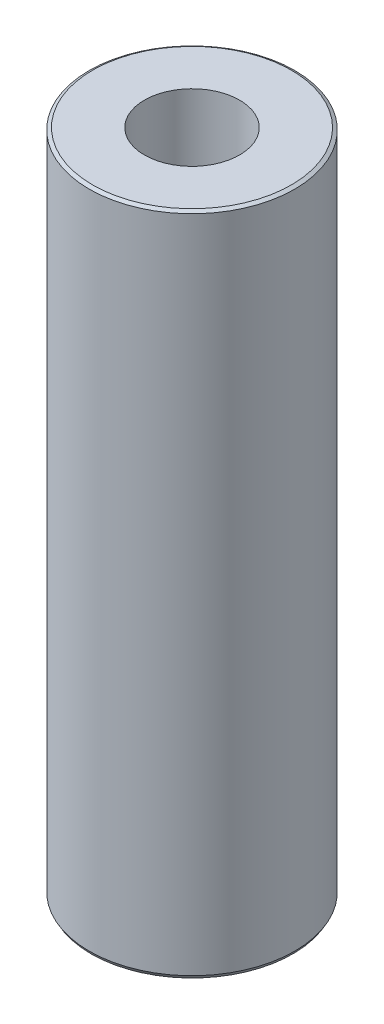
ISO-10303-21;
HEADER;
FILE_DESCRIPTION(('STEP AP214'),'2;1');
FILE_NAME('part.step','',(''),(''),'','','');
FILE_SCHEMA(('AUTOMOTIVE_DESIGN { 1 0 10303 214 1 1 1 1 }'));
ENDSEC;
DATA;
#1=APPLICATION_CONTEXT('core data for automotive mechanical design processes');
#2=APPLICATION_PROTOCOL_DEFINITION('international standard','automotive_design',2000,#1);
#3=PRODUCT_CONTEXT('',#1,'mechanical');
#4=PRODUCT('Part','Part','',(#3));
#5=PRODUCT_RELATED_PRODUCT_CATEGORY('part','',(#4));
#6=PRODUCT_DEFINITION_FORMATION('','',#4);
#7=PRODUCT_DEFINITION_CONTEXT('part definition',#1,'design');
#8=PRODUCT_DEFINITION('design','',#6,#7);
#9=PRODUCT_DEFINITION_SHAPE('','',#8);
#10=(LENGTH_UNIT() NAMED_UNIT(*) SI_UNIT(.MILLI.,.METRE.));
#11=(NAMED_UNIT(*) PLANE_ANGLE_UNIT() SI_UNIT($,.RADIAN.));
#12=(NAMED_UNIT(*) SI_UNIT($,.STERADIAN.) SOLID_ANGLE_UNIT());
#13=UNCERTAINTY_MEASURE_WITH_UNIT(LENGTH_MEASURE(1.E-05),#10,'distance_accuracy_value','');
#14=(GEOMETRIC_REPRESENTATION_CONTEXT(3) GLOBAL_UNCERTAINTY_ASSIGNED_CONTEXT((#13)) GLOBAL_UNIT_ASSIGNED_CONTEXT((#10,
#11,#12)) REPRESENTATION_CONTEXT('',''));
#15=CARTESIAN_POINT('',(0.,0.,0.));
#16=DIRECTION('',(0.,0.,1.));
#17=DIRECTION('',(1.,0.,0.));
#18=AXIS2_PLACEMENT_3D('',#15,#16,#17);
#19=CARTESIAN_POINT('',(0.,177.985862398713,0.));
#20=DIRECTION('',(0.,-1.,0.));
#21=DIRECTION('',(0.,0.,-1.));
#22=AXIS2_PLACEMENT_3D('',#19,#20,#21);
#23=CYLINDRICAL_SURFACE('',#22,27.5);
#24=CARTESIAN_POINT('',(0.,177.46178446057,0.));
#25=DIRECTION('',(0.,1.,0.));
#26=DIRECTION('',(0.,0.,1.));
#27=AXIS2_PLACEMENT_3D('',#24,#25,#26);
#28=CIRCLE('',#27,27.5);
#29=CARTESIAN_POINT('',(0.,177.46178446057,27.5));
#30=VERTEX_POINT('',#29);
#31=EDGE_CURVE('E50',#30,#30,#28,.F.);
#32=ORIENTED_EDGE('',*,*,#31,.T.);
#33=EDGE_LOOP('',(#32));
#34=FACE_BOUND('',#33,.T.);
#35=CARTESIAN_POINT('',(0.,0.907729615989311,0.));
#36=DIRECTION('',(0.,1.,0.));
#37=DIRECTION('',(0.,0.,1.));
#38=AXIS2_PLACEMENT_3D('',#35,#36,#37);
#39=CIRCLE('',#38,27.5);
#40=CARTESIAN_POINT('',(0.,0.907729615989311,27.5));
#41=VERTEX_POINT('',#40);
#42=EDGE_CURVE('E51',#41,#41,#39,.T.);
#43=ORIENTED_EDGE('',*,*,#42,.T.);
#44=EDGE_LOOP('',(#43));
#45=FACE_BOUND('',#44,.T.);
#46=ADVANCED_FACE('F39',(#34,#45),#23,.T.);
#47=CARTESIAN_POINT('',(0.,177.985862398713,0.));
#48=DIRECTION('',(0.,1.,0.));
#49=DIRECTION('',(0.,0.,1.));
#50=AXIS2_PLACEMENT_3D('',#47,#48,#49);
#51=PLANE('',#50);
#52=CARTESIAN_POINT('',(0.,177.985862398713,0.));
#53=DIRECTION('',(0.,1.,0.));
#54=DIRECTION('',(0.,0.,1.));
#55=AXIS2_PLACEMENT_3D('',#52,#53,#54);
#56=CIRCLE('',#55,26.5922703840107);
#57=CARTESIAN_POINT('',(0.,177.985862398713,26.5922703840107));
#58=VERTEX_POINT('',#57);
#59=EDGE_CURVE('E54',#58,#58,#56,.T.);
#60=ORIENTED_EDGE('',*,*,#59,.T.);
#61=EDGE_LOOP('',(#60));
#62=FACE_BOUND('',#61,.T.);
#63=CARTESIAN_POINT('',(0.,177.985862398713,0.));
#64=DIRECTION('',(0.,1.,0.));
#65=DIRECTION('',(0.,0.,1.));
#66=AXIS2_PLACEMENT_3D('',#63,#64,#65);
#67=CIRCLE('',#66,12.7258716913111);
#68=CARTESIAN_POINT('',(0.,177.985862398713,12.7258716913111));
#69=VERTEX_POINT('',#68);
#70=EDGE_CURVE('E58',#69,#69,#67,.T.);
#71=ORIENTED_EDGE('',*,*,#70,.F.);
#72=EDGE_LOOP('',(#71));
#73=FACE_BOUND('',#72,.T.);
#74=ADVANCED_FACE('F69',(#62,#73),#51,.T.);
#75=CARTESIAN_POINT('',(0.,0.,0.));
#76=DIRECTION('',(0.,1.,0.));
#77=DIRECTION('',(0.,0.,1.));
#78=AXIS2_PLACEMENT_3D('',#75,#76,#77);
#79=PLANE('',#78);
#80=CARTESIAN_POINT('',(0.,0.,0.));
#81=DIRECTION('',(0.,1.,0.));
#82=DIRECTION('',(0.,0.,1.));
#83=AXIS2_PLACEMENT_3D('',#80,#81,#82);
#84=CIRCLE('',#83,26.9759220618572);
#85=CARTESIAN_POINT('',(0.,0.,26.9759220618572));
#86=VERTEX_POINT('',#85);
#87=EDGE_CURVE('E10',#86,#86,#84,.F.);
#88=ORIENTED_EDGE('',*,*,#87,.T.);
#89=EDGE_LOOP('',(#88));
#90=FACE_BOUND('',#89,.T.);
#91=CARTESIAN_POINT('',(0.,0.,0.));
#92=DIRECTION('',(0.,1.,0.));
#93=DIRECTION('',(0.,0.,1.));
#94=AXIS2_PLACEMENT_3D('',#91,#92,#93);
#95=CIRCLE('',#94,12.7258716913111);
#96=CARTESIAN_POINT('',(0.,0.,12.7258716913111));
#97=VERTEX_POINT('',#96);
#98=EDGE_CURVE('E63',#97,#97,#95,.T.);
#99=ORIENTED_EDGE('',*,*,#98,.T.);
#100=EDGE_LOOP('',(#99));
#101=FACE_BOUND('',#100,.T.);
#102=ADVANCED_FACE('F75',(#90,#101),#79,.F.);
#103=CARTESIAN_POINT('',(0.,177.985862398713,0.));
#104=DIRECTION('',(0.,-1.,0.));
#105=DIRECTION('',(0.,0.,-1.));
#106=AXIS2_PLACEMENT_3D('',#103,#104,#105);
#107=CYLINDRICAL_SURFACE('',#106,12.7258716913111);
#108=ORIENTED_EDGE('',*,*,#70,.T.);
#109=EDGE_LOOP('',(#108));
#110=FACE_BOUND('',#109,.T.);
#111=ORIENTED_EDGE('',*,*,#98,.F.);
#112=EDGE_LOOP('',(#111));
#113=FACE_BOUND('',#112,.T.);
#114=ADVANCED_FACE('F70',(#110,#113),#107,.F.);
#115=CARTESIAN_POINT('',(0.,177.985862398713,0.));
#116=DIRECTION('',(0.,-1.,0.));
#117=DIRECTION('',(0.,0.,-1.));
#118=AXIS2_PLACEMENT_3D('',#115,#116,#117);
#119=CONICAL_SURFACE('',#118,26.5922703840107,1.04719755119659);
#120=ORIENTED_EDGE('',*,*,#31,.F.);
#121=EDGE_LOOP('',(#120));
#122=FACE_BOUND('',#121,.T.);
#123=ORIENTED_EDGE('',*,*,#59,.F.);
#124=EDGE_LOOP('',(#123));
#125=FACE_BOUND('',#124,.T.);
#126=ADVANCED_FACE('F81',(#122,#125),#119,.T.);
#127=CARTESIAN_POINT('',(0.,0.907729615989311,0.));
#128=DIRECTION('',(0.,1.,0.));
#129=DIRECTION('',(0.,0.,1.));
#130=AXIS2_PLACEMENT_3D('',#127,#128,#129);
#131=CONICAL_SURFACE('',#130,27.5,0.523598775598294);
#132=ORIENTED_EDGE('',*,*,#87,.F.);
#133=EDGE_LOOP('',(#132));
#134=FACE_BOUND('',#133,.T.);
#135=ORIENTED_EDGE('',*,*,#42,.F.);
#136=EDGE_LOOP('',(#135));
#137=FACE_BOUND('',#136,.T.);
#138=ADVANCED_FACE('F45',(#134,#137),#131,.T.);
#139=CLOSED_SHELL('',(#46,#74,#102,#114,#126,#138));
#140=MANIFOLD_SOLID_BREP('B2',#139);
#141=ADVANCED_BREP_SHAPE_REPRESENTATION('',(#18,#140),#14);
#142=SHAPE_DEFINITION_REPRESENTATION(#9,#141);
ENDSEC;
END-ISO-10303-21;
